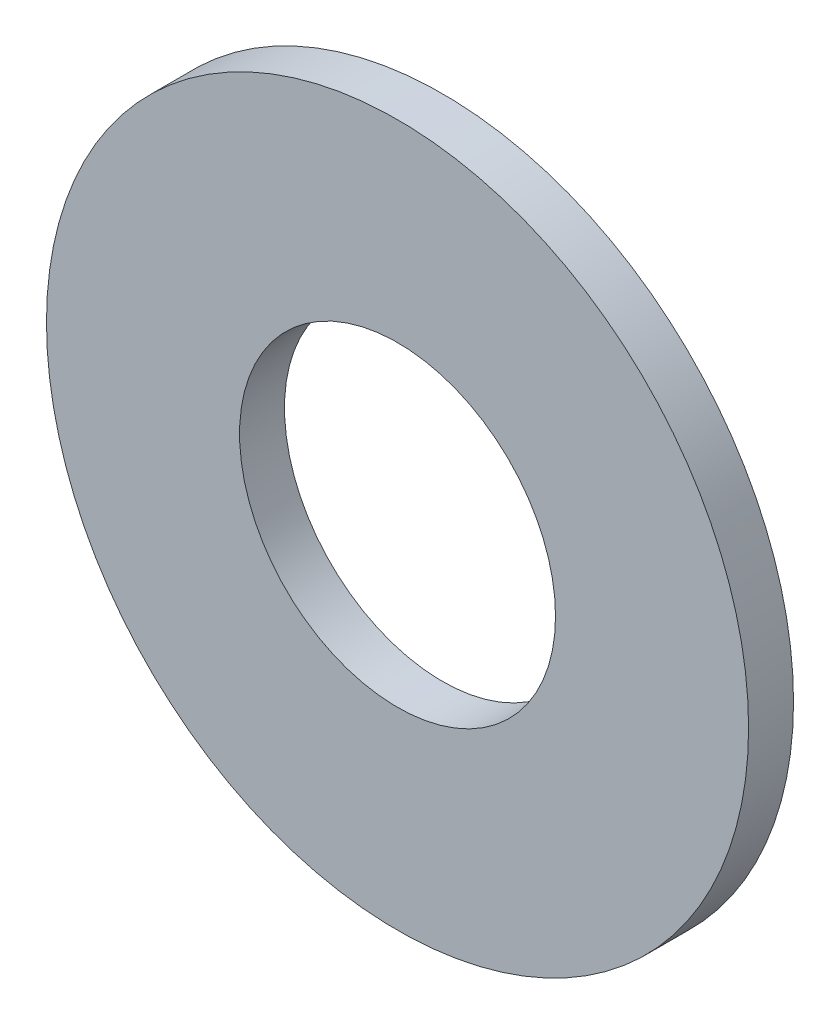
ISO-10303-21;
HEADER;
FILE_DESCRIPTION(('STEP AP214'),'2;1');
FILE_NAME('part.step','',(''),(''),'','','');
FILE_SCHEMA(('AUTOMOTIVE_DESIGN { 1 0 10303 214 1 1 1 1 }'));
ENDSEC;
DATA;
#1=APPLICATION_CONTEXT('core data for automotive mechanical design processes');
#2=APPLICATION_PROTOCOL_DEFINITION('international standard','automotive_design',2000,#1);
#3=PRODUCT_CONTEXT('',#1,'mechanical');
#4=PRODUCT('Part','Part','',(#3));
#5=PRODUCT_RELATED_PRODUCT_CATEGORY('part','',(#4));
#6=PRODUCT_DEFINITION_FORMATION('','',#4);
#7=PRODUCT_DEFINITION_CONTEXT('part definition',#1,'design');
#8=PRODUCT_DEFINITION('design','',#6,#7);
#9=PRODUCT_DEFINITION_SHAPE('','',#8);
#10=(LENGTH_UNIT() NAMED_UNIT(*) SI_UNIT(.MILLI.,.METRE.));
#11=(NAMED_UNIT(*) PLANE_ANGLE_UNIT() SI_UNIT($,.RADIAN.));
#12=(NAMED_UNIT(*) SI_UNIT($,.STERADIAN.) SOLID_ANGLE_UNIT());
#13=UNCERTAINTY_MEASURE_WITH_UNIT(LENGTH_MEASURE(1.E-05),#10,'distance_accuracy_value','');
#14=(GEOMETRIC_REPRESENTATION_CONTEXT(3) GLOBAL_UNCERTAINTY_ASSIGNED_CONTEXT((#13)) GLOBAL_UNIT_ASSIGNED_CONTEXT((#10,
#11,#12)) REPRESENTATION_CONTEXT('',''));
#15=CARTESIAN_POINT('',(0.,0.,0.));
#16=DIRECTION('',(0.,0.,1.));
#17=DIRECTION('',(1.,0.,0.));
#18=AXIS2_PLACEMENT_3D('',#15,#16,#17);
#19=CARTESIAN_POINT('',(0.,0.,-1.016));
#20=DIRECTION('',(0.,0.,1.));
#21=DIRECTION('',(1.,0.,0.));
#22=AXIS2_PLACEMENT_3D('',#19,#20,#21);
#23=CYLINDRICAL_SURFACE('',#22,7.9375);
#24=CARTESIAN_POINT('',(0.,0.,-1.016));
#25=DIRECTION('',(0.,0.,1.));
#26=DIRECTION('',(1.,0.,0.));
#27=AXIS2_PLACEMENT_3D('',#24,#25,#26);
#28=CIRCLE('',#27,7.9375);
#29=CARTESIAN_POINT('',(7.9375,0.,-1.016));
#30=VERTEX_POINT('',#29);
#31=EDGE_CURVE('E10',#30,#30,#28,.T.);
#32=ORIENTED_EDGE('',*,*,#31,.T.);
#33=EDGE_LOOP('',(#32));
#34=FACE_BOUND('',#33,.T.);
#35=CARTESIAN_POINT('',(0.,0.,0.));
#36=DIRECTION('',(0.,0.,1.));
#37=DIRECTION('',(1.,0.,0.));
#38=AXIS2_PLACEMENT_3D('',#35,#36,#37);
#39=CIRCLE('',#38,7.9375);
#40=CARTESIAN_POINT('',(7.9375,0.,0.));
#41=VERTEX_POINT('',#40);
#42=EDGE_CURVE('E33',#41,#41,#39,.T.);
#43=ORIENTED_EDGE('',*,*,#42,.F.);
#44=EDGE_LOOP('',(#43));
#45=FACE_BOUND('',#44,.T.);
#46=ADVANCED_FACE('F30',(#34,#45),#23,.T.);
#47=CARTESIAN_POINT('',(0.,0.,-1.016));
#48=DIRECTION('',(0.,0.,1.));
#49=DIRECTION('',(1.,0.,0.));
#50=AXIS2_PLACEMENT_3D('',#47,#48,#49);
#51=PLANE('',#50);
#52=CARTESIAN_POINT('',(0.,0.,-1.016));
#53=DIRECTION('',(0.,0.,1.));
#54=DIRECTION('',(1.,0.,0.));
#55=AXIS2_PLACEMENT_3D('',#52,#53,#54);
#56=CIRCLE('',#55,3.571875);
#57=CARTESIAN_POINT('',(3.571875,0.,-1.016));
#58=VERTEX_POINT('',#57);
#59=EDGE_CURVE('E40',#58,#58,#56,.T.);
#60=ORIENTED_EDGE('',*,*,#59,.T.);
#61=EDGE_LOOP('',(#60));
#62=FACE_BOUND('',#61,.T.);
#63=ORIENTED_EDGE('',*,*,#31,.F.);
#64=EDGE_LOOP('',(#63));
#65=FACE_BOUND('',#64,.T.);
#66=ADVANCED_FACE('F48',(#62,#65),#51,.F.);
#67=CARTESIAN_POINT('',(0.,0.,0.));
#68=DIRECTION('',(0.,0.,1.));
#69=DIRECTION('',(1.,0.,0.));
#70=AXIS2_PLACEMENT_3D('',#67,#68,#69);
#71=PLANE('',#70);
#72=CARTESIAN_POINT('',(0.,0.,0.));
#73=DIRECTION('',(0.,0.,1.));
#74=DIRECTION('',(1.,0.,0.));
#75=AXIS2_PLACEMENT_3D('',#72,#73,#74);
#76=CIRCLE('',#75,3.571875);
#77=CARTESIAN_POINT('',(3.571875,0.,0.));
#78=VERTEX_POINT('',#77);
#79=EDGE_CURVE('E42',#78,#78,#76,.T.);
#80=ORIENTED_EDGE('',*,*,#79,.F.);
#81=EDGE_LOOP('',(#80));
#82=FACE_BOUND('',#81,.T.);
#83=ORIENTED_EDGE('',*,*,#42,.T.);
#84=EDGE_LOOP('',(#83));
#85=FACE_BOUND('',#84,.T.);
#86=ADVANCED_FACE('F54',(#82,#85),#71,.T.);
#87=CARTESIAN_POINT('',(0.,0.,-1.016));
#88=DIRECTION('',(0.,0.,1.));
#89=DIRECTION('',(1.,0.,0.));
#90=AXIS2_PLACEMENT_3D('',#87,#88,#89);
#91=CYLINDRICAL_SURFACE('',#90,3.571875);
#92=ORIENTED_EDGE('',*,*,#59,.F.);
#93=EDGE_LOOP('',(#92));
#94=FACE_BOUND('',#93,.T.);
#95=ORIENTED_EDGE('',*,*,#79,.T.);
#96=EDGE_LOOP('',(#95));
#97=FACE_BOUND('',#96,.T.);
#98=ADVANCED_FACE('F51',(#94,#97),#91,.F.);
#99=CLOSED_SHELL('',(#46,#66,#86,#98));
#100=MANIFOLD_SOLID_BREP('B2',#99);
#101=ADVANCED_BREP_SHAPE_REPRESENTATION('',(#18,#100),#14);
#102=SHAPE_DEFINITION_REPRESENTATION(#9,#101);
ENDSEC;
END-ISO-10303-21;
